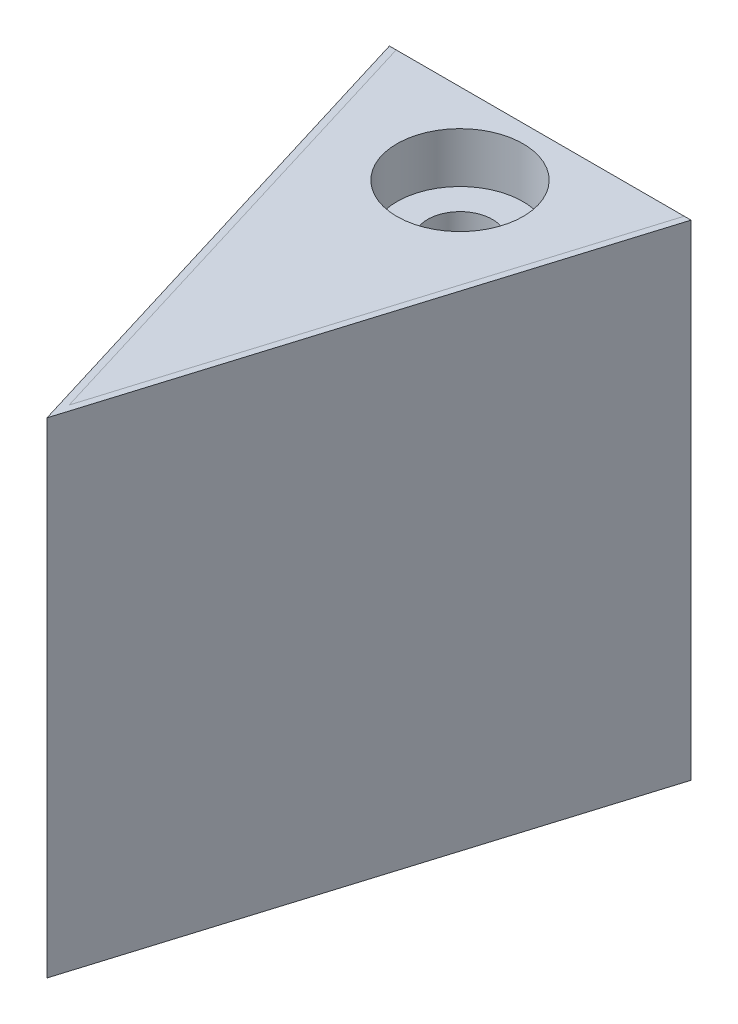
ISO-10303-21;
HEADER;
FILE_DESCRIPTION(('STEP AP214'),'2;1');
FILE_NAME('part.step','',(''),(''),'','','');
FILE_SCHEMA(('AUTOMOTIVE_DESIGN { 1 0 10303 214 1 1 1 1 }'));
ENDSEC;
DATA;
#1=APPLICATION_CONTEXT('core data for automotive mechanical design processes');
#2=APPLICATION_PROTOCOL_DEFINITION('international standard','automotive_design',2000,#1);
#3=PRODUCT_CONTEXT('',#1,'mechanical');
#4=PRODUCT('Part','Part','',(#3));
#5=PRODUCT_RELATED_PRODUCT_CATEGORY('part','',(#4));
#6=PRODUCT_DEFINITION_FORMATION('','',#4);
#7=PRODUCT_DEFINITION_CONTEXT('part definition',#1,'design');
#8=PRODUCT_DEFINITION('design','',#6,#7);
#9=PRODUCT_DEFINITION_SHAPE('','',#8);
#10=(LENGTH_UNIT() NAMED_UNIT(*) SI_UNIT(.MILLI.,.METRE.));
#11=(NAMED_UNIT(*) PLANE_ANGLE_UNIT() SI_UNIT($,.RADIAN.));
#12=(NAMED_UNIT(*) SI_UNIT($,.STERADIAN.) SOLID_ANGLE_UNIT());
#13=UNCERTAINTY_MEASURE_WITH_UNIT(LENGTH_MEASURE(1.E-05),#10,'distance_accuracy_value','');
#14=(GEOMETRIC_REPRESENTATION_CONTEXT(3) GLOBAL_UNCERTAINTY_ASSIGNED_CONTEXT((#13)) GLOBAL_UNIT_ASSIGNED_CONTEXT((#10,
#11,#12)) REPRESENTATION_CONTEXT('',''));
#15=CARTESIAN_POINT('',(0.,0.,0.));
#16=DIRECTION('',(0.,0.,1.));
#17=DIRECTION('',(1.,0.,0.));
#18=AXIS2_PLACEMENT_3D('',#15,#16,#17);
#19=CARTESIAN_POINT('',(-4.47328382881108,-2.51,4.56537000902889));
#20=DIRECTION('',(0.956304755963033,0.,-0.292371704722745));
#21=DIRECTION('',(-0.292371704722745,0.,-0.956304755963033));
#22=AXIS2_PLACEMENT_3D('',#19,#20,#21);
#23=PLANE('',#22);
#24=DIRECTION('',(0.,1.,0.));
#25=VECTOR('',#24,1.);
#26=CARTESIAN_POINT('',(-0.0200292878637927,-2.51,19.1313092850622));
#27=LINE('',#26,#25);
#28=CARTESIAN_POINT('',(-0.0200292878637948,-2.5,19.1313092850622));
#29=VERTEX_POINT('',#28);
#30=CARTESIAN_POINT('',(-0.0200292878637948,12.5,19.1313092850622));
#31=VERTEX_POINT('',#30);
#32=EDGE_CURVE('E12',#29,#31,#27,.T.);
#33=ORIENTED_EDGE('',*,*,#32,.F.);
#34=DIRECTION('',(-0.292371704722745,0.,-0.956304755963033));
#35=VECTOR('',#34,1.);
#36=CARTESIAN_POINT('',(-5.36736335318275,-2.5,1.64096765560485));
#37=LINE('',#36,#35);
#38=CARTESIAN_POINT('',(-4.47328382881108,-2.5,4.56537000902889));
#39=VERTEX_POINT('',#38);
#40=EDGE_CURVE('E119',#29,#39,#37,.T.);
#41=ORIENTED_EDGE('',*,*,#40,.T.);
#42=DIRECTION('',(0.,-1.,0.));
#43=VECTOR('',#42,1.);
#44=CARTESIAN_POINT('',(-4.47328382881108,-2.5,4.56537000902889));
#45=LINE('',#44,#43);
#46=CARTESIAN_POINT('',(-4.47328382881108,12.5,4.56537000902889));
#47=VERTEX_POINT('',#46);
#48=EDGE_CURVE('E115',#47,#39,#45,.T.);
#49=ORIENTED_EDGE('',*,*,#48,.F.);
#50=DIRECTION('',(-0.292371704722745,0.,-0.956304755963033));
#51=VECTOR('',#50,1.);
#52=CARTESIAN_POINT('',(-5.36736335318275,12.5,1.64096765560485));
#53=LINE('',#52,#51);
#54=EDGE_CURVE('E126',#31,#47,#53,.T.);
#55=ORIENTED_EDGE('',*,*,#54,.F.);
#56=EDGE_LOOP('',(#33,#41,#49,#55));
#57=FACE_BOUND('',#56,.T.);
#58=ADVANCED_FACE('F44',(#57),#23,.T.);
#59=CARTESIAN_POINT('',(-0.0200292878637927,-2.51,19.1313092850622));
#60=DIRECTION('',(-0.956304755963036,0.,-0.292371704722737));
#61=DIRECTION('',(-0.292371704722737,0.,0.956304755963036));
#62=AXIS2_PLACEMENT_3D('',#59,#60,#61);
#63=PLANE('',#62);
#64=DIRECTION('',(0.,1.,0.));
#65=VECTOR('',#64,1.);
#66=CARTESIAN_POINT('',(4.43322525308335,-2.5,4.56537000902889));
#67=LINE('',#66,#65);
#68=CARTESIAN_POINT('',(4.43322525308335,-2.5,4.56537000902889));
#69=VERTEX_POINT('',#68);
#70=CARTESIAN_POINT('',(4.43322525308335,12.5,4.56537000902889));
#71=VERTEX_POINT('',#70);
#72=EDGE_CURVE('E103',#69,#71,#67,.T.);
#73=ORIENTED_EDGE('',*,*,#72,.F.);
#74=DIRECTION('',(-0.292371704722737,0.,0.956304755963036));
#75=VECTOR('',#74,1.);
#76=CARTESIAN_POINT('',(5.33072903312821,-2.5,1.62976741996975));
#77=LINE('',#76,#75);
#78=EDGE_CURVE('E112',#69,#29,#77,.T.);
#79=ORIENTED_EDGE('',*,*,#78,.T.);
#80=ORIENTED_EDGE('',*,*,#32,.T.);
#81=DIRECTION('',(-0.292371704722737,0.,0.956304755963036));
#82=VECTOR('',#81,1.);
#83=CARTESIAN_POINT('',(5.33072903312821,12.5,1.62976741996975));
#84=LINE('',#83,#82);
#85=EDGE_CURVE('E114',#71,#31,#84,.T.);
#86=ORIENTED_EDGE('',*,*,#85,.F.);
#87=EDGE_LOOP('',(#73,#79,#80,#86));
#88=FACE_BOUND('',#87,.T.);
#89=ADVANCED_FACE('F111',(#88),#63,.T.);
#90=CARTESIAN_POINT('',(0.,12.5,0.));
#91=DIRECTION('',(0.,1.,0.));
#92=DIRECTION('',(0.,0.,1.));
#93=AXIS2_PLACEMENT_3D('',#90,#91,#92);
#94=PLANE('',#93);
#95=DIRECTION('',(-1.,0.,0.));
#96=VECTOR('',#95,1.);
#97=CARTESIAN_POINT('',(4.64236360438078,12.5,4.56537000902889));
#98=LINE('',#97,#96);
#99=CARTESIAN_POINT('',(4.64236360438078,12.5,4.56537000902889));
#100=VERTEX_POINT('',#99);
#101=EDGE_CURVE('E48',#100,#71,#98,.T.);
#102=ORIENTED_EDGE('',*,*,#101,.T.);
#103=ORIENTED_EDGE('',*,*,#85,.T.);
#104=ORIENTED_EDGE('',*,*,#54,.T.);
#105=CARTESIAN_POINT('',(-4.68242218010851,12.5,4.56537000902889));
#106=VERTEX_POINT('',#105);
#107=EDGE_CURVE('E133',#47,#106,#98,.T.);
#108=ORIENTED_EDGE('',*,*,#107,.T.);
#109=DIRECTION('',(0.292371704722747,0.,0.956304755963032));
#110=VECTOR('',#109,1.);
#111=CARTESIAN_POINT('',(-0.0200292878637907,12.5,19.8153700090289));
#112=LINE('',#111,#110);
#113=CARTESIAN_POINT('',(-0.0200292878637907,12.5,19.8153700090289));
#114=VERTEX_POINT('',#113);
#115=EDGE_CURVE('E53',#106,#114,#112,.T.);
#116=ORIENTED_EDGE('',*,*,#115,.T.);
#117=DIRECTION('',(0.292371704722737,0.,-0.956304755963035));
#118=VECTOR('',#117,1.);
#119=CARTESIAN_POINT('',(0.973595426876858,12.5,16.5653700090289));
#120=LINE('',#119,#118);
#121=EDGE_CURVE('E131',#114,#100,#120,.T.);
#122=ORIENTED_EDGE('',*,*,#121,.T.);
#123=EDGE_LOOP('',(#102,#103,#104,#108,#116,#122));
#124=FACE_BOUND('',#123,.T.);
#125=ADVANCED_FACE('F148',(#124),#94,.T.);
#126=CARTESIAN_POINT('',(4.64236360438078,-2.5,4.56537000902889));
#127=DIRECTION('',(0.,0.,-1.));
#128=DIRECTION('',(-1.,0.,0.));
#129=AXIS2_PLACEMENT_3D('',#126,#127,#128);
#130=PLANE('',#129);
#131=DIRECTION('',(-1.,0.,0.));
#132=VECTOR('',#131,1.);
#133=CARTESIAN_POINT('',(4.64236360438078,-2.5,4.56537000902889));
#134=LINE('',#133,#132);
#135=CARTESIAN_POINT('',(4.64236360438078,-2.5,4.56537000902889));
#136=VERTEX_POINT('',#135);
#137=EDGE_CURVE('E99',#136,#69,#134,.T.);
#138=ORIENTED_EDGE('',*,*,#137,.T.);
#139=ORIENTED_EDGE('',*,*,#72,.T.);
#140=ORIENTED_EDGE('',*,*,#101,.F.);
#141=DIRECTION('',(0.,1.,0.));
#142=VECTOR('',#141,1.);
#143=CARTESIAN_POINT('',(4.64236360438078,-2.5,4.56537000902889));
#144=LINE('',#143,#142);
#145=EDGE_CURVE('E68',#136,#100,#144,.T.);
#146=ORIENTED_EDGE('',*,*,#145,.F.);
#147=EDGE_LOOP('',(#138,#139,#140,#146));
#148=FACE_BOUND('',#147,.T.);
#149=ADVANCED_FACE('F101',(#148),#130,.T.);
#150=CARTESIAN_POINT('',(0.973595426876858,-2.5,16.5653700090289));
#151=DIRECTION('',(0.956304755963036,0.,0.292371704722736));
#152=DIRECTION('',(0.292371704722736,0.,-0.956304755963036));
#153=AXIS2_PLACEMENT_3D('',#150,#151,#152);
#154=PLANE('',#153);
#155=ORIENTED_EDGE('',*,*,#145,.T.);
#156=ORIENTED_EDGE('',*,*,#121,.F.);
#157=DIRECTION('',(0.,1.,0.));
#158=VECTOR('',#157,1.);
#159=CARTESIAN_POINT('',(-0.0200292878637907,-2.5,19.8153700090289));
#160=LINE('',#159,#158);
#161=CARTESIAN_POINT('',(-0.0200292878637907,-2.5,19.8153700090289));
#162=VERTEX_POINT('',#161);
#163=EDGE_CURVE('E61',#162,#114,#160,.T.);
#164=ORIENTED_EDGE('',*,*,#163,.F.);
#165=DIRECTION('',(0.292371704722737,0.,-0.956304755963035));
#166=VECTOR('',#165,1.);
#167=CARTESIAN_POINT('',(0.973595426876858,-2.5,16.5653700090289));
#168=LINE('',#167,#166);
#169=EDGE_CURVE('E136',#162,#136,#168,.T.);
#170=ORIENTED_EDGE('',*,*,#169,.T.);
#171=EDGE_LOOP('',(#155,#156,#164,#170));
#172=FACE_BOUND('',#171,.T.);
#173=ADVANCED_FACE('F163',(#172),#154,.T.);
#174=CARTESIAN_POINT('',(-1.01365400260447,-2.5,16.5653700090289));
#175=DIRECTION('',(-0.956304755963033,0.,0.292371704722745));
#176=DIRECTION('',(0.292371704722745,0.,0.956304755963033));
#177=AXIS2_PLACEMENT_3D('',#174,#175,#176);
#178=PLANE('',#177);
#179=ORIENTED_EDGE('',*,*,#163,.T.);
#180=ORIENTED_EDGE('',*,*,#115,.F.);
#181=DIRECTION('',(0.,1.,0.));
#182=VECTOR('',#181,1.);
#183=CARTESIAN_POINT('',(-4.68242218010851,-2.5,4.56537000902889));
#184=LINE('',#183,#182);
#185=CARTESIAN_POINT('',(-4.68242218010851,-2.5,4.56537000902889));
#186=VERTEX_POINT('',#185);
#187=EDGE_CURVE('E127',#186,#106,#184,.T.);
#188=ORIENTED_EDGE('',*,*,#187,.F.);
#189=DIRECTION('',(0.292371704722747,0.,0.956304755963032));
#190=VECTOR('',#189,1.);
#191=CARTESIAN_POINT('',(-0.0200292878637907,-2.5,19.8153700090289));
#192=LINE('',#191,#190);
#193=EDGE_CURVE('E134',#186,#162,#192,.T.);
#194=ORIENTED_EDGE('',*,*,#193,.T.);
#195=EDGE_LOOP('',(#179,#180,#188,#194));
#196=FACE_BOUND('',#195,.T.);
#197=ADVANCED_FACE('F146',(#196),#178,.T.);
#198=ORIENTED_EDGE('',*,*,#107,.F.);
#199=ORIENTED_EDGE('',*,*,#48,.T.);
#200=EDGE_CURVE('E108',#39,#186,#134,.T.);
#201=ORIENTED_EDGE('',*,*,#200,.T.);
#202=ORIENTED_EDGE('',*,*,#187,.T.);
#203=EDGE_LOOP('',(#198,#199,#201,#202));
#204=FACE_BOUND('',#203,.T.);
#205=ADVANCED_FACE('F144',(#204),#130,.T.);
#206=CARTESIAN_POINT('',(0.,-2.5,0.));
#207=DIRECTION('',(0.,1.,0.));
#208=DIRECTION('',(0.,0.,1.));
#209=AXIS2_PLACEMENT_3D('',#206,#207,#208);
#210=PLANE('',#209);
#211=ORIENTED_EDGE('',*,*,#78,.F.);
#212=ORIENTED_EDGE('',*,*,#137,.F.);
#213=ORIENTED_EDGE('',*,*,#169,.F.);
#214=ORIENTED_EDGE('',*,*,#193,.F.);
#215=ORIENTED_EDGE('',*,*,#200,.F.);
#216=ORIENTED_EDGE('',*,*,#40,.F.);
#217=EDGE_LOOP('',(#211,#212,#213,#214,#215,#216));
#218=FACE_BOUND('',#217,.T.);
#219=ADVANCED_FACE('F46',(#218),#210,.F.);
#220=CLOSED_SHELL('',(#58,#89,#125,#149,#173,#197,#205,#219));
#221=MANIFOLD_SOLID_BREP('B2',#220);
#222=CARTESIAN_POINT('',(-4.47328382881108,-2.51,4.56537000902889));
#223=DIRECTION('',(0.956304755963033,0.,-0.292371704722745));
#224=DIRECTION('',(-0.292371704722745,0.,-0.956304755963033));
#225=AXIS2_PLACEMENT_3D('',#222,#223,#224);
#226=PLANE('',#225);
#227=DIRECTION('',(0.,1.,0.));
#228=VECTOR('',#227,1.);
#229=CARTESIAN_POINT('',(-0.0200292878637927,-2.51,19.1313092850622));
#230=LINE('',#229,#228);
#231=CARTESIAN_POINT('',(-0.0200292878637948,-2.5,19.1313092850622));
#232=VERTEX_POINT('',#231);
#233=CARTESIAN_POINT('',(-0.0200292878637948,12.5,19.1313092850622));
#234=VERTEX_POINT('',#233);
#235=EDGE_CURVE('E42',#232,#234,#230,.T.);
#236=ORIENTED_EDGE('',*,*,#235,.T.);
#237=DIRECTION('',(-0.292371704722745,0.,-0.956304755963033));
#238=VECTOR('',#237,1.);
#239=CARTESIAN_POINT('',(-5.36736335318275,12.5,1.64096765560485));
#240=LINE('',#239,#238);
#241=CARTESIAN_POINT('',(-4.47328382881108,12.5,4.56537000902889));
#242=VERTEX_POINT('',#241);
#243=EDGE_CURVE('E231',#234,#242,#240,.T.);
#244=ORIENTED_EDGE('',*,*,#243,.T.);
#245=DIRECTION('',(0.,-1.,0.));
#246=VECTOR('',#245,1.);
#247=CARTESIAN_POINT('',(-4.47328382881108,-2.5,4.56537000902889));
#248=LINE('',#247,#246);
#249=CARTESIAN_POINT('',(-4.47328382881108,-2.5,4.56537000902889));
#250=VERTEX_POINT('',#249);
#251=EDGE_CURVE('E247',#242,#250,#248,.T.);
#252=ORIENTED_EDGE('',*,*,#251,.T.);
#253=DIRECTION('',(-0.292371704722745,0.,-0.956304755963033));
#254=VECTOR('',#253,1.);
#255=CARTESIAN_POINT('',(-5.36736335318275,-2.5,1.64096765560485));
#256=LINE('',#255,#254);
#257=EDGE_CURVE('E332',#232,#250,#256,.T.);
#258=ORIENTED_EDGE('',*,*,#257,.F.);
#259=EDGE_LOOP('',(#236,#244,#252,#258));
#260=FACE_BOUND('',#259,.T.);
#261=ADVANCED_FACE('F222',(#260),#226,.F.);
#262=CARTESIAN_POINT('',(-0.0200292878637927,-2.51,19.1313092850622));
#263=DIRECTION('',(-0.956304755963036,0.,-0.292371704722737));
#264=DIRECTION('',(-0.292371704722737,0.,0.956304755963036));
#265=AXIS2_PLACEMENT_3D('',#262,#263,#264);
#266=PLANE('',#265);
#267=DIRECTION('',(0.,1.,0.));
#268=VECTOR('',#267,1.);
#269=CARTESIAN_POINT('',(4.43322525308335,-2.5,4.56537000902889));
#270=LINE('',#269,#268);
#271=CARTESIAN_POINT('',(4.43322525308335,-2.5,4.56537000902889));
#272=VERTEX_POINT('',#271);
#273=CARTESIAN_POINT('',(4.43322525308335,12.5,4.56537000902889));
#274=VERTEX_POINT('',#273);
#275=EDGE_CURVE('E345',#272,#274,#270,.T.);
#276=ORIENTED_EDGE('',*,*,#275,.T.);
#277=DIRECTION('',(-0.292371704722737,0.,0.956304755963036));
#278=VECTOR('',#277,1.);
#279=CARTESIAN_POINT('',(5.33072903312821,12.5,1.62976741996975));
#280=LINE('',#279,#278);
#281=EDGE_CURVE('E239',#274,#234,#280,.T.);
#282=ORIENTED_EDGE('',*,*,#281,.T.);
#283=ORIENTED_EDGE('',*,*,#235,.F.);
#284=DIRECTION('',(-0.292371704722737,0.,0.956304755963036));
#285=VECTOR('',#284,1.);
#286=CARTESIAN_POINT('',(5.33072903312821,-2.5,1.62976741996975));
#287=LINE('',#286,#285);
#288=EDGE_CURVE('E226',#272,#232,#287,.T.);
#289=ORIENTED_EDGE('',*,*,#288,.F.);
#290=EDGE_LOOP('',(#276,#282,#283,#289));
#291=FACE_BOUND('',#290,.T.);
#292=ADVANCED_FACE('F224',(#291),#266,.F.);
#293=CARTESIAN_POINT('',(-0.0200292878638651,5.,9.56537000902889));
#294=DIRECTION('',(0.,0.,-1.));
#295=DIRECTION('',(-1.,0.,0.));
#296=AXIS2_PLACEMENT_3D('',#293,#294,#295);
#297=PLANE('',#296);
#298=CARTESIAN_POINT('',(-0.0200292878638651,5.,9.56537000902889));
#299=DIRECTION('',(0.,0.,-1.));
#300=DIRECTION('',(-1.,0.,0.));
#301=AXIS2_PLACEMENT_3D('',#298,#299,#300);
#302=CIRCLE('',#301,3.05);
#303=CARTESIAN_POINT('',(2.87824606137402,4.05,9.56537000902889));
#304=VERTEX_POINT('',#303);
#305=CARTESIAN_POINT('',(-2.91830463710175,4.05,9.56537000902889));
#306=VERTEX_POINT('',#305);
#307=EDGE_CURVE('E313',#304,#306,#302,.T.);
#308=ORIENTED_EDGE('',*,*,#307,.T.);
#309=DIRECTION('',(1.,0.,0.));
#310=VECTOR('',#309,1.);
#311=CARTESIAN_POINT('',(2.87824606137402,4.05,9.56537000902889));
#312=LINE('',#311,#310);
#313=EDGE_CURVE('E316',#306,#304,#312,.T.);
#314=ORIENTED_EDGE('',*,*,#313,.T.);
#315=EDGE_LOOP('',(#308,#314));
#316=FACE_BOUND('',#315,.T.);
#317=ADVANCED_FACE('F412',(#316),#297,.T.);
#318=CARTESIAN_POINT('',(0.,-2.5,7.06537000902889));
#319=DIRECTION('',(0.,1.,0.));
#320=DIRECTION('',(0.,0.,1.));
#321=AXIS2_PLACEMENT_3D('',#318,#319,#320);
#322=CYLINDRICAL_SURFACE('',#321,0.999999999999795);
#323=CARTESIAN_POINT('',(0.,5.95,7.06537000902889));
#324=DIRECTION('',(0.,-1.,0.));
#325=DIRECTION('',(0.,0.,-1.));
#326=AXIS2_PLACEMENT_3D('',#323,#324,#325);
#327=CIRCLE('',#326,0.999999999999795);
#328=CARTESIAN_POINT('',(0.,5.95,6.06537000902909));
#329=VERTEX_POINT('',#328);
#330=EDGE_CURVE('E333',#329,#329,#327,.T.);
#331=ORIENTED_EDGE('',*,*,#330,.F.);
#332=EDGE_LOOP('',(#331));
#333=FACE_BOUND('',#332,.T.);
#334=CARTESIAN_POINT('',(0.,4.05,7.06537000902889));
#335=DIRECTION('',(0.,1.,0.));
#336=DIRECTION('',(0.,0.,1.));
#337=AXIS2_PLACEMENT_3D('',#334,#335,#336);
#338=CIRCLE('',#337,0.999999999999795);
#339=CARTESIAN_POINT('',(0.,4.05,8.06537000902868));
#340=VERTEX_POINT('',#339);
#341=EDGE_CURVE('E378',#340,#340,#338,.T.);
#342=ORIENTED_EDGE('',*,*,#341,.F.);
#343=EDGE_LOOP('',(#342));
#344=FACE_BOUND('',#343,.T.);
#345=ADVANCED_FACE('F388',(#333,#344),#322,.F.);
#346=CARTESIAN_POINT('',(-0.0200292878638651,5.,9.56537000902889));
#347=DIRECTION('',(0.,0.,-1.));
#348=DIRECTION('',(-1.,0.,0.));
#349=AXIS2_PLACEMENT_3D('',#346,#347,#348);
#350=PLANE('',#349);
#351=CARTESIAN_POINT('',(-0.0200292878638651,5.,9.56537000902889));
#352=DIRECTION('',(0.,0.,-1.));
#353=DIRECTION('',(-1.,0.,0.));
#354=AXIS2_PLACEMENT_3D('',#351,#352,#353);
#355=CIRCLE('',#354,3.05);
#356=CARTESIAN_POINT('',(-2.91830463710175,5.95,9.56537000902889));
#357=VERTEX_POINT('',#356);
#358=CARTESIAN_POINT('',(2.87824606137402,5.95,9.56537000902889));
#359=VERTEX_POINT('',#358);
#360=EDGE_CURVE('E289',#357,#359,#355,.T.);
#361=ORIENTED_EDGE('',*,*,#360,.T.);
#362=DIRECTION('',(-1.,0.,0.));
#363=VECTOR('',#362,1.);
#364=CARTESIAN_POINT('',(2.87824606137402,5.95,9.56537000902889));
#365=LINE('',#364,#363);
#366=EDGE_CURVE('E298',#359,#357,#365,.T.);
#367=ORIENTED_EDGE('',*,*,#366,.T.);
#368=EDGE_LOOP('',(#361,#367));
#369=FACE_BOUND('',#368,.T.);
#370=ADVANCED_FACE('F301',(#369),#350,.T.);
#371=CARTESIAN_POINT('',(0.,8.04993423332826,8.06537000902868));
#372=CARTESIAN_POINT('',(0.0546821791008591,8.04957510796066,8.06537003134291));
#373=CARTESIAN_POINT('',(0.109354914126314,8.04773172784493,8.0608700796451));
#374=CARTESIAN_POINT('',(0.217072928600975,8.04124911512673,8.0430513451388));
#375=CARTESIAN_POINT('',(0.270117951898954,8.03660944482241,8.02973118167488));
#376=CARTESIAN_POINT('',(0.373013096085542,8.02501178523379,7.9947834956713));
#377=CARTESIAN_POINT('',(0.422868473539478,8.01805773388006,7.97317007466059));
#378=CARTESIAN_POINT('',(0.518239677542278,8.00251631313627,7.92231226129294));
#379=CARTESIAN_POINT('',(0.563754694999946,7.99392864011109,7.89306644995588));
#380=CARTESIAN_POINT('',(0.650728756928365,7.97567153728033,7.82670873711478));
#381=CARTESIAN_POINT('',(0.692016888170353,7.96597671144104,7.789379829442));
#382=CARTESIAN_POINT('',(0.767869116779319,7.94673554743408,7.7083762283634));
#383=CARTESIAN_POINT('',(0.802431776578928,7.93718924141278,7.66470018173609));
#384=CARTESIAN_POINT('',(0.864765151781457,7.91902793004534,7.5707826132558));
#385=CARTESIAN_POINT('',(0.892326299349008,7.91044519441132,7.52039518357941));
#386=CARTESIAN_POINT('',(0.938505856826815,7.89556616206647,7.41536260915563));
#387=CARTESIAN_POINT('',(0.957127077871142,7.88926914676962,7.36071880910146));
#388=CARTESIAN_POINT('',(0.984242433141647,7.87995461814357,7.25073786122397));
#389=CARTESIAN_POINT('',(0.993067689027361,7.87683020189835,7.19549165552765));
#390=CARTESIAN_POINT('',(1.00137637507627,7.87389140563375,7.0842210997125));
#391=CARTESIAN_POINT('',(1.00086267310011,7.87407600946129,7.02819699375629));
#392=CARTESIAN_POINT('',(0.99076096088365,7.87764266918273,6.91967266210838));
#393=CARTESIAN_POINT('',(0.981587657973599,7.88087859001705,6.86712821582431));
#394=CARTESIAN_POINT('',(0.955100149434765,7.8899509641507,6.76437204334019));
#395=CARTESIAN_POINT('',(0.937784973426303,7.89578772742408,6.71416059597993));
#396=CARTESIAN_POINT('',(0.895224866547381,7.90952145894585,6.61653210436769));
#397=CARTESIAN_POINT('',(0.869854126003332,7.91745075100137,6.56917464604347));
#398=CARTESIAN_POINT('',(0.811993742784764,7.93447527343163,6.47925869308694));
#399=CARTESIAN_POINT('',(0.779502046774439,7.94357083978839,6.43670158801433));
#400=CARTESIAN_POINT('',(0.706310455681535,7.96250407370069,6.35524458013623));
#401=CARTESIAN_POINT('',(0.665269123333407,7.97235562915799,6.31665408360598));
#402=CARTESIAN_POINT('',(0.57718349640282,7.99129803558887,6.24682351617368));
#403=CARTESIAN_POINT('',(0.530138584475256,8.00038880817212,6.21558420213093));
#404=CARTESIAN_POINT('',(0.430676287465459,8.01694054662288,6.16106484602444));
#405=CARTESIAN_POINT('',(0.378205748438876,8.0243825903494,6.13787563631923));
#406=CARTESIAN_POINT('',(0.269803272333861,8.03668686866806,6.10075330920549));
#407=CARTESIAN_POINT('',(0.213872509814023,8.04154997336318,6.08681706955583));
#408=CARTESIAN_POINT('',(0.102675980012124,8.04801791966975,6.06913107849329));
#409=CARTESIAN_POINT('',(0.0474822649655247,8.04975195790472,6.06497514173016));
#410=CARTESIAN_POINT('',(-0.0628415625782379,8.05019803748363,6.0658238541015));
#411=CARTESIAN_POINT('',(-0.11797168444029,8.04891060250071,6.07082691579136));
#412=CARTESIAN_POINT('',(-0.224905098860222,8.04356865345438,6.0895227717292));
#413=CARTESIAN_POINT('',(-0.27675855569376,8.03959688095123,6.10295488916953));
#414=CARTESIAN_POINT('',(-0.377465816854332,8.02940636298488,6.13781410513821));
#415=CARTESIAN_POINT('',(-0.426319262034692,8.02318734910412,6.15924215873627));
#416=CARTESIAN_POINT('',(-0.520961047176242,8.00897230857037,6.2100604659352));
#417=CARTESIAN_POINT('',(-0.566646489467878,8.0009368899842,6.2396309979426));
#418=CARTESIAN_POINT('',(-0.65254261544519,7.98401517307969,6.30568228657445));
#419=CARTESIAN_POINT('',(-0.692751707956591,7.97512862873551,6.34216504424128));
#420=CARTESIAN_POINT('',(-0.768368832186386,7.9570367257478,6.42287653863802));
#421=CARTESIAN_POINT('',(-0.803492685593696,7.94783427305369,6.46737277538544));
#422=CARTESIAN_POINT('',(-0.865812896971176,7.93056297373217,6.561814306128));
#423=CARTESIAN_POINT('',(-0.893009191170616,7.92249413622404,6.61175964395225));
#424=CARTESIAN_POINT('',(-0.938600028099442,7.908487452095,6.71573217026841));
#425=CARTESIAN_POINT('',(-0.957006080265417,7.90254682148472,6.76975391336835));
#426=CARTESIAN_POINT('',(-0.984385447206509,7.89356679235751,6.88036261430816));
#427=CARTESIAN_POINT('',(-0.993362642639482,7.89052620031194,6.93694850680402));
#428=CARTESIAN_POINT('',(-1.00133163032267,7.88782991758724,7.04818230585044));
#429=CARTESIAN_POINT('',(-1.00077845522218,7.8880199719282,7.10279422493158));
#430=CARTESIAN_POINT('',(-0.990816979227545,7.89138344959095,7.21110590212351));
#431=CARTESIAN_POINT('',(-0.981409159874996,7.89455671067717,7.26480570967594));
#432=CARTESIAN_POINT('',(-0.954326006544325,7.90340934975765,7.36885594585062));
#433=CARTESIAN_POINT('',(-0.936795159679116,7.9090448351629,7.41924801009586));
#434=CARTESIAN_POINT('',(-0.894078597598813,7.92216267155434,7.51641516301269));
#435=CARTESIAN_POINT('',(-0.868891247980455,7.92964541680364,7.56318947674054));
#436=CARTESIAN_POINT('',(-0.810369867509382,7.94598359665686,7.6538685388687));
#437=CARTESIAN_POINT('',(-0.776744477808668,7.95488269367938,7.69757735474066));
#438=CARTESIAN_POINT('',(-0.702796321419838,7.97283954400193,7.77888143930107));
#439=CARTESIAN_POINT('',(-0.662471761379352,7.98189733920272,7.81647506561977));
#440=CARTESIAN_POINT('',(-0.574566833244119,7.99951060425292,7.88580532807814));
#441=CARTESIAN_POINT('',(-0.526781666832324,8.00803733466461,7.91729045245042));
#442=CARTESIAN_POINT('',(-0.42631739774142,8.02324420992155,7.97174481231142));
#443=CARTESIAN_POINT('',(-0.373639825535698,8.02992492966523,7.99471669981805));
#444=CARTESIAN_POINT('',(-0.268082191246842,8.04033135878708,8.03027889077588));
#445=CARTESIAN_POINT('',(-0.215395649662781,8.0442075496374,8.0433995880839));
#446=CARTESIAN_POINT('',(-0.108469393021745,8.04918673358594,8.06094409709436));
#447=CARTESIAN_POINT('',(-0.0542300522364904,8.05029038935139,8.06536998689896));
#448=CARTESIAN_POINT('',(0.,8.04993423332826,8.06537000902868));
#449=B_SPLINE_CURVE_WITH_KNOTS('',3,(#371,#372,#373,#374,#375,#376,#377,#378,#379,#380,#381,
#382,#383,#384,#385,#386,#387,#388,#389,#390,#391,#392,#393,#394,#395,#396,#397,#398,#399,#400,
#401,#402,#403,#404,#405,#406,#407,#408,#409,#410,#411,#412,#413,#414,#415,#416,#417,#418,#419,
#420,#421,#422,#423,#424,#425,#426,#427,#428,#429,#430,#431,#432,#433,#434,#435,#436,#437,#438,
#439,#440,#441,#442,#443,#444,#445,#446,#447,#448),.UNSPECIFIED.,.T.,.F.,(4,2,2,2,2,2,2,2,2,2,2,
2,2,2,2,2,2,2,2,2,2,2,2,2,2,2,2,2,2,2,2,2,2,2,2,2,2,2,4),(0.,0.163850025249576,
0.327725704522648,0.491323962064708,0.654952656763252,0.823688007705309,0.992459386251062,
1.16580686426493,1.33909979790541,1.50633759959778,1.67352404581624,1.83308952664912,
1.99267402993055,2.15488479838887,2.31714240219587,2.48792062945066,2.65871643191758,
2.83138111770078,3.00398751137513,3.16928819199399,3.33456022528501,3.49495717905625,
3.65537329747941,3.81967478229688,3.98402390415546,4.15550728499603,4.32699204524211,
4.49825165341348,4.66944074819149,4.83247997411711,4.99551033400225,5.15574601024891,
5.31601591541804,5.48284858292629,5.64972598333098,5.8224532304353,5.99512662474744,
6.15766074540814,6.32015601487876),.UNSPECIFIED.);
#450=CARTESIAN_POINT('',(0.,8.04993423332826,8.06537000902868));
#451=VERTEX_POINT('',#450);
#452=EDGE_CURVE('E336',#451,#451,#449,.T.);
#453=ORIENTED_EDGE('',*,*,#452,.F.);
#454=EDGE_LOOP('',(#453));
#455=FACE_BOUND('',#454,.T.);
#456=CARTESIAN_POINT('',(0.,10.95,7.06537000902889));
#457=DIRECTION('',(0.,1.,0.));
#458=DIRECTION('',(0.,0.,1.));
#459=AXIS2_PLACEMENT_3D('',#456,#457,#458);
#460=CIRCLE('',#459,0.999999999999795);
#461=CARTESIAN_POINT('',(0.,10.95,8.06537000902868));
#462=VERTEX_POINT('',#461);
#463=EDGE_CURVE('E338',#462,#462,#460,.F.);
#464=ORIENTED_EDGE('',*,*,#463,.F.);
#465=EDGE_LOOP('',(#464));
#466=FACE_BOUND('',#465,.T.);
#467=ADVANCED_FACE('F387',(#455,#466),#322,.F.);
#468=CARTESIAN_POINT('',(0.,10.95,7.06537000902889));
#469=DIRECTION('',(0.,1.,0.));
#470=DIRECTION('',(0.,0.,1.));
#471=AXIS2_PLACEMENT_3D('',#468,#469,#470);
#472=PLANE('',#471);
#473=CARTESIAN_POINT('',(0.,10.95,7.06537000902889));
#474=DIRECTION('',(0.,1.,0.));
#475=DIRECTION('',(0.,0.,1.));
#476=AXIS2_PLACEMENT_3D('',#473,#474,#475);
#477=CIRCLE('',#476,1.95);
#478=CARTESIAN_POINT('',(0.,10.95,9.01537000902889));
#479=VERTEX_POINT('',#478);
#480=EDGE_CURVE('E341',#479,#479,#477,.T.);
#481=ORIENTED_EDGE('',*,*,#480,.T.);
#482=EDGE_LOOP('',(#481));
#483=FACE_BOUND('',#482,.T.);
#484=ORIENTED_EDGE('',*,*,#463,.T.);
#485=EDGE_LOOP('',(#484));
#486=FACE_BOUND('',#485,.T.);
#487=ADVANCED_FACE('F429',(#483,#486),#472,.T.);
#488=CARTESIAN_POINT('',(2.87824606137402,4.05,9.56537000902889));
#489=DIRECTION('',(0.,1.,0.));
#490=DIRECTION('',(0.,0.,1.));
#491=AXIS2_PLACEMENT_3D('',#488,#489,#490);
#492=PLANE('',#491);
#493=ORIENTED_EDGE('',*,*,#341,.T.);
#494=EDGE_LOOP('',(#493));
#495=FACE_BOUND('',#494,.T.);
#496=DIRECTION('',(1.,0.,0.));
#497=VECTOR('',#496,1.);
#498=CARTESIAN_POINT('',(2.87824606137402,4.05,4.56537000902889));
#499=LINE('',#498,#497);
#500=CARTESIAN_POINT('',(-2.91830463710175,4.05,4.56537000902889));
#501=VERTEX_POINT('',#500);
#502=CARTESIAN_POINT('',(2.87824606137402,4.05,4.56537000902889));
#503=VERTEX_POINT('',#502);
#504=EDGE_CURVE('E317',#501,#503,#499,.T.);
#505=ORIENTED_EDGE('',*,*,#504,.T.);
#506=DIRECTION('',(0.,0.,-1.));
#507=VECTOR('',#506,1.);
#508=CARTESIAN_POINT('',(2.87824606137402,4.05,9.56537000902889));
#509=LINE('',#508,#507);
#510=EDGE_CURVE('E324',#304,#503,#509,.T.);
#511=ORIENTED_EDGE('',*,*,#510,.F.);
#512=ORIENTED_EDGE('',*,*,#313,.F.);
#513=DIRECTION('',(0.,0.,-1.));
#514=VECTOR('',#513,1.);
#515=CARTESIAN_POINT('',(-2.91830463710175,4.05,9.56537000902889));
#516=LINE('',#515,#514);
#517=EDGE_CURVE('E320',#306,#501,#516,.T.);
#518=ORIENTED_EDGE('',*,*,#517,.T.);
#519=EDGE_LOOP('',(#505,#511,#512,#518));
#520=FACE_BOUND('',#519,.T.);
#521=ADVANCED_FACE('F401',(#495,#520),#492,.F.);
#522=CARTESIAN_POINT('',(-0.0200292878638651,5.,9.56537000902889));
#523=DIRECTION('',(0.,0.,-1.));
#524=DIRECTION('',(-1.,0.,0.));
#525=AXIS2_PLACEMENT_3D('',#522,#523,#524);
#526=CYLINDRICAL_SURFACE('',#525,3.05);
#527=CARTESIAN_POINT('',(0.,1.95006576667174,8.06537000902868));
#528=CARTESIAN_POINT('',(-0.0545467083170213,1.94970747285087,8.06537014842768));
#529=CARTESIAN_POINT('',(-0.109102594425875,1.95082617973328,8.0608924995377));
#530=CARTESIAN_POINT('',(-0.216630559947825,1.95586683343102,8.04314372343465));
#531=CARTESIAN_POINT('',(-0.269602455019722,1.95978910520613,8.02987157686885));
#532=CARTESIAN_POINT('',(-0.372395540865111,1.96998281568037,7.9950275098491));
#533=CARTESIAN_POINT('',(-0.422221565195225,1.97625054265354,7.973468701733));
#534=CARTESIAN_POINT('',(-0.517558158763021,1.99046661490332,7.92272142069787));
#535=CARTESIAN_POINT('',(-0.563067913976883,1.9984152762853,7.89353151248061));
#536=CARTESIAN_POINT('',(-0.649966255197754,2.0154231807719,7.82735020137387));
#537=CARTESIAN_POINT('',(-0.691194169171496,2.02450822082243,7.79015451043477));
#538=CARTESIAN_POINT('',(-0.766956256715783,2.04261595831002,7.7094526800914));
#539=CARTESIAN_POINT('',(-0.801489039696813,2.05163864242117,7.66594523299885));
#540=CARTESIAN_POINT('',(-0.863833114798163,2.06886144062743,7.57236170710818));
#541=CARTESIAN_POINT('',(-0.891427757355958,2.07703123807653,7.5221351619421));
#542=CARTESIAN_POINT('',(-0.937715224095409,2.09122999962885,7.41745339240553));
#543=CARTESIAN_POINT('',(-0.956410489644233,2.09725955075052,7.36299933254285));
#544=CARTESIAN_POINT('',(-0.98378774157987,2.10623552314352,7.25316209699885));
#545=CARTESIAN_POINT('',(-0.992758921547917,2.10927073194073,7.19785848159756));
#546=CARTESIAN_POINT('',(-1.00133622536939,2.1121705310223,7.08645414512163));
#547=CARTESIAN_POINT('',(-1.00094504098822,2.11203603262665,7.03035365779079));
#548=CARTESIAN_POINT('',(-0.991038308718468,2.10869152283109,6.92147912268892));
#549=CARTESIAN_POINT('',(-0.981911130689609,2.10561242249054,6.86866501351363));
#550=CARTESIAN_POINT('',(-0.955426185023448,2.09694560803578,6.76536168143749));
#551=CARTESIAN_POINT('',(-0.938067486579282,2.09135761022334,6.71487272216934));
#552=CARTESIAN_POINT('',(-0.895355477528405,2.07821837470153,6.6167672431692));
#553=CARTESIAN_POINT('',(-0.869886126954097,2.07063893932841,6.5692051855977));
#554=CARTESIAN_POINT('',(-0.811753224255465,2.05439616233121,6.47890419675966));
#555=CARTESIAN_POINT('',(-0.779087700884409,2.04573252399295,6.43616659191586));
#556=CARTESIAN_POINT('',(-0.705621370189618,2.02780243830253,6.35455640683283));
#557=CARTESIAN_POINT('',(-0.664503649472307,2.01852709526581,6.31597050530051));
#558=CARTESIAN_POINT('',(-0.57625917050636,2.00081162712214,6.24616898216816));
#559=CARTESIAN_POINT('',(-0.529131951252226,1.99237156618035,6.21495392653086));
#560=CARTESIAN_POINT('',(-0.42967631027486,1.97721392807559,6.16059752963539));
#561=CARTESIAN_POINT('',(-0.377310405391615,1.97051020892516,6.13752064297751));
#562=CARTESIAN_POINT('',(-0.269171299120882,1.9597079998363,6.10058591678685));
#563=CARTESIAN_POINT('',(-0.213399241292621,1.95560864074058,6.08672500152104));
#564=CARTESIAN_POINT('',(-0.10253908456766,1.95063259271298,6.06912548318687));
#565=CARTESIAN_POINT('',(-0.0475199824239522,1.94962825812152,6.06498767267624));
#566=CARTESIAN_POINT('',(0.0624178408306011,1.95061930503421,6.06580783262257));
#567=CARTESIAN_POINT('',(0.117336575934049,1.95261423039507,6.07076441998072));
#568=CARTESIAN_POINT('',(0.224019697915292,1.95932166494474,6.08932142334608));
#569=CARTESIAN_POINT('',(0.275829029613629,1.96396161104079,6.10269199072763));
#570=CARTESIAN_POINT('',(0.376441018754687,1.97545416982598,6.1374016340776));
#571=CARTESIAN_POINT('',(0.425243272951458,1.98230707850544,6.15874177606015));
#572=CARTESIAN_POINT('',(0.519942958677845,1.99778474493448,6.20943615236094));
#573=CARTESIAN_POINT('',(0.565724086676077,2.00645292462781,6.23899404054972));
#574=CARTESIAN_POINT('',(0.65180500165392,2.02458793082162,6.30504407730197));
#575=CARTESIAN_POINT('',(0.692103118494657,2.03405499924922,6.34153833062207));
#576=CARTESIAN_POINT('',(0.767932225486806,2.05327037108428,6.42234306540777));
#577=CARTESIAN_POINT('',(0.803172677487142,2.06301253612594,6.46692833440378));
#578=CARTESIAN_POINT('',(0.865699423276716,2.08125899142385,6.5616021249502));
#579=CARTESIAN_POINT('',(0.892985766856479,2.08976328942864,6.61169061204926));
#580=CARTESIAN_POINT('',(0.938651779165637,2.10448494111707,6.71586576519746));
#581=CARTESIAN_POINT('',(0.957065998669795,2.11071114322027,6.76993596046547));
#582=CARTESIAN_POINT('',(0.984445615434366,2.12011390689645,6.88066589489971));
#583=CARTESIAN_POINT('',(0.993415282022461,2.12329184635206,6.93732445192374));
#584=CARTESIAN_POINT('',(1.00132679388868,2.12609197133263,7.04845788777591));
#585=CARTESIAN_POINT('',(1.00076507768828,2.12589019545742,7.10289342027352));
#586=CARTESIAN_POINT('',(0.990844746741187,2.12238627741313,7.21085016959212));
#587=CARTESIAN_POINT('',(0.981486635847406,2.11908431282127,7.26437143860285));
#588=CARTESIAN_POINT('',(0.954582416471499,2.1098742046831,7.36800345557402));
#589=CARTESIAN_POINT('',(0.937190144831295,2.10401513574912,7.41815883854906));
#590=CARTESIAN_POINT('',(0.894835988822796,2.090358382842,7.51487803621554));
#591=CARTESIAN_POINT('',(0.869872431323104,2.08256027044038,7.56144105419678));
#592=CARTESIAN_POINT('',(0.811804845722808,2.06546338643234,7.65187315687851));
#593=CARTESIAN_POINT('',(0.778391036585527,2.05611369258926,7.69553364274029));
#594=CARTESIAN_POINT('',(0.704904242322278,2.03716191630836,7.77678571189248));
#595=CARTESIAN_POINT('',(0.664829330890099,2.02755976154021,7.81437553340602));
#596=CARTESIAN_POINT('',(0.577262492650444,2.0087087644859,7.88391432033876));
#597=CARTESIAN_POINT('',(0.529540250451134,1.99948882586492,7.91558208528871));
#598=CARTESIAN_POINT('',(0.42915302715261,1.98282933317401,7.97040925400301));
#599=CARTESIAN_POINT('',(0.376489408870778,1.97538929021161,7.99357099509525));
#600=CARTESIAN_POINT('',(0.270526055479718,1.96342787080536,8.02962243255354));
#601=CARTESIAN_POINT('',(0.21740168051063,1.95877488381879,8.04298349104672));
#602=CARTESIAN_POINT('',(0.109520989825704,1.95227407622703,8.06085600970638));
#603=CARTESIAN_POINT('',(0.0547651206314484,1.95042549514897,8.06536986907151));
#604=CARTESIAN_POINT('',(0.,1.95006576667174,8.06537000902868));
#605=B_SPLINE_CURVE_WITH_KNOTS('',3,(#527,#528,#529,#530,#531,#532,#533,#534,#535,#536,#537,
#538,#539,#540,#541,#542,#543,#544,#545,#546,#547,#548,#549,#550,#551,#552,#553,#554,#555,#556,
#557,#558,#559,#560,#561,#562,#563,#564,#565,#566,#567,#568,#569,#570,#571,#572,#573,#574,#575,
#576,#577,#578,#579,#580,#581,#582,#583,#584,#585,#586,#587,#588,#589,#590,#591,#592,#593,#594,
#595,#596,#597,#598,#599,#600,#601,#602,#603,#604),.UNSPECIFIED.,.T.,.F.,(4,2,2,2,2,2,2,2,2,2,2,
2,2,2,2,2,2,2,2,2,2,2,2,2,2,2,2,2,2,2,2,2,2,2,2,2,2,2,4),(0.,0.163442738145022,
0.326904423927134,0.490108515076376,0.653343324638449,0.821381387841708,0.989454315519196,
1.16225995148931,1.33501815430968,1.50248425360626,1.66990220544567,1.83020712775361,
1.99053018140408,2.15325864915569,2.31603174864767,2.48667281288232,2.65732697535582,
2.82930387628821,3.00122335289978,3.16595058911983,3.33065277528572,3.49104017270917,
3.65144903131624,3.81625518004188,3.98111141728132,4.15327611944035,4.32543974387269,
4.49692737970757,4.66833746273024,4.83084843459238,4.993350098478,5.15286155264116,
5.31240828196405,5.4789731824826,5.64558633552872,5.81877562096729,5.9919172809142,
6.15605898403024,6.32015616875538),.UNSPECIFIED.);
#606=CARTESIAN_POINT('',(0.,1.95006576667174,8.06537000902868));
#607=VERTEX_POINT('',#606);
#608=EDGE_CURVE('E309',#607,#607,#605,.T.);
#609=ORIENTED_EDGE('',*,*,#608,.T.);
#610=EDGE_LOOP('',(#609));
#611=FACE_BOUND('',#610,.T.);
#612=CARTESIAN_POINT('',(-0.0200292878638651,5.,4.56537000902889));
#613=DIRECTION('',(0.,0.,-1.));
#614=DIRECTION('',(-1.,0.,0.));
#615=AXIS2_PLACEMENT_3D('',#612,#613,#614);
#616=CIRCLE('',#615,3.05);
#617=EDGE_CURVE('E311',#503,#501,#616,.T.);
#618=ORIENTED_EDGE('',*,*,#617,.T.);
#619=ORIENTED_EDGE('',*,*,#517,.F.);
#620=ORIENTED_EDGE('',*,*,#307,.F.);
#621=ORIENTED_EDGE('',*,*,#510,.T.);
#622=EDGE_LOOP('',(#618,#619,#620,#621));
#623=FACE_BOUND('',#622,.T.);
#624=ADVANCED_FACE('F397',(#611,#623),#526,.F.);
#625=CARTESIAN_POINT('',(2.87824606137402,5.95,9.56537000902889));
#626=DIRECTION('',(0.,-1.,0.));
#627=DIRECTION('',(0.,0.,-1.));
#628=AXIS2_PLACEMENT_3D('',#625,#626,#627);
#629=PLANE('',#628);
#630=ORIENTED_EDGE('',*,*,#330,.T.);
#631=EDGE_LOOP('',(#630));
#632=FACE_BOUND('',#631,.T.);
#633=DIRECTION('',(-1.,0.,0.));
#634=VECTOR('',#633,1.);
#635=CARTESIAN_POINT('',(2.87824606137402,5.95,4.56537000902889));
#636=LINE('',#635,#634);
#637=CARTESIAN_POINT('',(2.87824606137402,5.95,4.56537000902889));
#638=VERTEX_POINT('',#637);
#639=CARTESIAN_POINT('',(-2.91830463710175,5.95,4.56537000902889));
#640=VERTEX_POINT('',#639);
#641=EDGE_CURVE('E302',#638,#640,#636,.T.);
#642=ORIENTED_EDGE('',*,*,#641,.T.);
#643=DIRECTION('',(0.,0.,-1.));
#644=VECTOR('',#643,1.);
#645=CARTESIAN_POINT('',(-2.91830463710175,5.95,9.56537000902889));
#646=LINE('',#645,#644);
#647=EDGE_CURVE('E297',#357,#640,#646,.T.);
#648=ORIENTED_EDGE('',*,*,#647,.F.);
#649=ORIENTED_EDGE('',*,*,#366,.F.);
#650=DIRECTION('',(0.,0.,-1.));
#651=VECTOR('',#650,1.);
#652=CARTESIAN_POINT('',(2.87824606137402,5.95,9.56537000902889));
#653=LINE('',#652,#651);
#654=EDGE_CURVE('E286',#359,#638,#653,.T.);
#655=ORIENTED_EDGE('',*,*,#654,.T.);
#656=EDGE_LOOP('',(#642,#648,#649,#655));
#657=FACE_BOUND('',#656,.T.);
#658=ADVANCED_FACE('F304',(#632,#657),#629,.F.);
#659=CARTESIAN_POINT('',(-0.0200292878638651,5.,9.56537000902889));
#660=DIRECTION('',(0.,0.,-1.));
#661=DIRECTION('',(-1.,0.,0.));
#662=AXIS2_PLACEMENT_3D('',#659,#660,#661);
#663=CYLINDRICAL_SURFACE('',#662,3.05);
#664=ORIENTED_EDGE('',*,*,#452,.T.);
#665=EDGE_LOOP('',(#664));
#666=FACE_BOUND('',#665,.T.);
#667=CARTESIAN_POINT('',(-0.0200292878638651,5.,4.56537000902889));
#668=DIRECTION('',(0.,0.,-1.));
#669=DIRECTION('',(-1.,0.,0.));
#670=AXIS2_PLACEMENT_3D('',#667,#668,#669);
#671=CIRCLE('',#670,3.05);
#672=EDGE_CURVE('E292',#640,#638,#671,.T.);
#673=ORIENTED_EDGE('',*,*,#672,.T.);
#674=ORIENTED_EDGE('',*,*,#654,.F.);
#675=ORIENTED_EDGE('',*,*,#360,.F.);
#676=ORIENTED_EDGE('',*,*,#647,.T.);
#677=EDGE_LOOP('',(#673,#674,#675,#676));
#678=FACE_BOUND('',#677,.T.);
#679=ADVANCED_FACE('F288',(#666,#678),#663,.F.);
#680=CARTESIAN_POINT('',(0.,10.95,7.06537000902889));
#681=DIRECTION('',(0.,1.,0.));
#682=DIRECTION('',(0.,0.,1.));
#683=AXIS2_PLACEMENT_3D('',#680,#681,#682);
#684=CYLINDRICAL_SURFACE('',#683,1.95);
#685=CARTESIAN_POINT('',(0.,12.5,7.06537000902889));
#686=DIRECTION('',(0.,1.,0.));
#687=DIRECTION('',(0.,0.,1.));
#688=AXIS2_PLACEMENT_3D('',#685,#686,#687);
#689=CIRCLE('',#688,1.95);
#690=CARTESIAN_POINT('',(0.,12.5,9.01537000902889));
#691=VERTEX_POINT('',#690);
#692=EDGE_CURVE('E363',#691,#691,#689,.T.);
#693=CARTESIAN_POINT('',(0.,10.95,9.01537000902889));
#694=CARTESIAN_POINT('',(0.,10.9661458333333,9.01537000902889));
#695=CARTESIAN_POINT('',(0.,10.9822916666667,9.01537000902889));
#696=CARTESIAN_POINT('',(0.,11.0145833333333,9.01537000902889));
#697=CARTESIAN_POINT('',(0.,11.0307291666667,9.01537000902889));
#698=CARTESIAN_POINT('',(0.,11.0630208333333,9.01537000902889));
#699=CARTESIAN_POINT('',(0.,11.0791666666667,9.01537000902889));
#700=CARTESIAN_POINT('',(0.,11.1114583333333,9.01537000902889));
#701=CARTESIAN_POINT('',(0.,11.1276041666667,9.01537000902889));
#702=CARTESIAN_POINT('',(0.,11.1598958333333,9.01537000902889));
#703=CARTESIAN_POINT('',(0.,11.1760416666667,9.01537000902889));
#704=CARTESIAN_POINT('',(0.,11.2083333333333,9.01537000902889));
#705=CARTESIAN_POINT('',(0.,11.2244791666667,9.01537000902889));
#706=CARTESIAN_POINT('',(0.,11.2567708333333,9.01537000902889));
#707=CARTESIAN_POINT('',(0.,11.2729166666667,9.01537000902889));
#708=CARTESIAN_POINT('',(0.,11.3052083333333,9.01537000902889));
#709=CARTESIAN_POINT('',(0.,11.3213541666667,9.01537000902889));
#710=CARTESIAN_POINT('',(0.,11.3536458333333,9.01537000902889));
#711=CARTESIAN_POINT('',(0.,11.3697916666667,9.01537000902889));
#712=CARTESIAN_POINT('',(0.,11.4020833333333,9.01537000902889));
#713=CARTESIAN_POINT('',(0.,11.4182291666667,9.01537000902889));
#714=CARTESIAN_POINT('',(0.,11.4505208333333,9.01537000902889));
#715=CARTESIAN_POINT('',(0.,11.4666666666667,9.01537000902889));
#716=CARTESIAN_POINT('',(0.,11.4989583333333,9.01537000902889));
#717=CARTESIAN_POINT('',(0.,11.5151041666667,9.01537000902889));
#718=CARTESIAN_POINT('',(0.,11.5473958333333,9.01537000902889));
#719=CARTESIAN_POINT('',(0.,11.5635416666667,9.01537000902889));
#720=CARTESIAN_POINT('',(0.,11.5958333333333,9.01537000902889));
#721=CARTESIAN_POINT('',(0.,11.6119791666667,9.01537000902889));
#722=CARTESIAN_POINT('',(0.,11.6442708333333,9.01537000902889));
#723=CARTESIAN_POINT('',(0.,11.6604166666667,9.01537000902889));
#724=CARTESIAN_POINT('',(0.,11.6927083333333,9.01537000902889));
#725=CARTESIAN_POINT('',(0.,11.7088541666667,9.01537000902889));
#726=CARTESIAN_POINT('',(0.,11.7411458333333,9.01537000902889));
#727=CARTESIAN_POINT('',(0.,11.7572916666667,9.01537000902889));
#728=CARTESIAN_POINT('',(0.,11.7895833333333,9.01537000902889));
#729=CARTESIAN_POINT('',(0.,11.8057291666667,9.01537000902889));
#730=CARTESIAN_POINT('',(0.,11.8380208333333,9.01537000902889));
#731=CARTESIAN_POINT('',(0.,11.8541666666667,9.01537000902889));
#732=CARTESIAN_POINT('',(0.,11.8864583333333,9.01537000902889));
#733=CARTESIAN_POINT('',(0.,11.9026041666667,9.01537000902889));
#734=CARTESIAN_POINT('',(0.,11.9348958333333,9.01537000902889));
#735=CARTESIAN_POINT('',(0.,11.9510416666667,9.01537000902889));
#736=CARTESIAN_POINT('',(0.,11.9833333333333,9.01537000902889));
#737=CARTESIAN_POINT('',(0.,11.9994791666667,9.01537000902889));
#738=CARTESIAN_POINT('',(0.,12.0317708333333,9.01537000902889));
#739=CARTESIAN_POINT('',(0.,12.0479166666667,9.01537000902889));
#740=CARTESIAN_POINT('',(0.,12.0802083333333,9.01537000902889));
#741=CARTESIAN_POINT('',(0.,12.0963541666667,9.01537000902889));
#742=CARTESIAN_POINT('',(0.,12.1286458333333,9.01537000902889));
#743=CARTESIAN_POINT('',(0.,12.1447916666667,9.01537000902889));
#744=CARTESIAN_POINT('',(0.,12.1770833333333,9.01537000902889));
#745=CARTESIAN_POINT('',(0.,12.1932291666667,9.01537000902889));
#746=CARTESIAN_POINT('',(0.,12.2255208333333,9.01537000902889));
#747=CARTESIAN_POINT('',(0.,12.2416666666667,9.01537000902889));
#748=CARTESIAN_POINT('',(0.,12.2739583333333,9.01537000902889));
#749=CARTESIAN_POINT('',(0.,12.2901041666667,9.01537000902889));
#750=CARTESIAN_POINT('',(0.,12.3223958333333,9.01537000902889));
#751=CARTESIAN_POINT('',(0.,12.3385416666667,9.01537000902889));
#752=CARTESIAN_POINT('',(0.,12.3708333333333,9.01537000902889));
#753=CARTESIAN_POINT('',(0.,12.3869791666667,9.01537000902889));
#754=CARTESIAN_POINT('',(0.,12.4192708333333,9.01537000902889));
#755=CARTESIAN_POINT('',(0.,12.4354166666667,9.01537000902889));
#756=CARTESIAN_POINT('',(0.,12.4677083333333,9.01537000902889));
#757=CARTESIAN_POINT('',(0.,12.4838541666667,9.01537000902889));
#758=CARTESIAN_POINT('',(0.,12.5,9.01537000902889));
#759=B_SPLINE_CURVE_WITH_KNOTS('',3,(#693,#694,#695,#696,#697,#698,#699,#700,#701,#702,#703,
#704,#705,#706,#707,#708,#709,#710,#711,#712,#713,#714,#715,#716,#717,#718,#719,#720,#721,#722,
#723,#724,#725,#726,#727,#728,#729,#730,#731,#732,#733,#734,#735,#736,#737,#738,#739,#740,#741,
#742,#743,#744,#745,#746,#747,#748,#749,#750,#751,#752,#753,#754,#755,#756,#757,#758),
.UNSPECIFIED.,.F.,.F.,(4,2,2,2,2,2,2,2,2,2,2,2,2,2,2,2,2,2,2,2,2,2,2,2,2,2,2,2,2,2,2,2,4),(0.,
0.0484375000000016,0.0968750000000015,0.145312500000001,0.193750000000001,0.242187500000001,
0.290625000000001,0.339062500000001,0.387500000000001,0.435937500000001,0.484375,0.5328125,
0.58125,0.6296875,0.678125,0.7265625,0.775,0.823437500000001,0.871875000000001,
0.920312500000001,0.968750000000001,1.0171875,1.065625,1.1140625,1.1625,1.2109375,1.259375,
1.3078125,1.35625,1.4046875,1.453125,1.5015625,1.55),.UNSPECIFIED.);
#760=EDGE_CURVE('BSEAM389',#479,#691,#759,.T.);
#761=ORIENTED_EDGE('',*,*,#480,.F.);
#762=ORIENTED_EDGE('',*,*,#692,.T.);
#763=ORIENTED_EDGE('',*,*,#760,.T.);
#764=ORIENTED_EDGE('',*,*,#760,.F.);
#765=EDGE_LOOP('',(#761,#763,#762,#764));
#766=FACE_BOUND('',#765,.T.);
#767=ADVANCED_FACE('F389',(#766),#684,.F.);
#768=CARTESIAN_POINT('',(4.64236360438078,-2.5,4.56537000902889));
#769=DIRECTION('',(0.,0.,-1.));
#770=DIRECTION('',(-1.,0.,0.));
#771=AXIS2_PLACEMENT_3D('',#768,#769,#770);
#772=PLANE('',#771);
#773=ORIENTED_EDGE('',*,*,#275,.F.);
#774=DIRECTION('',(-1.,0.,0.));
#775=VECTOR('',#774,1.);
#776=CARTESIAN_POINT('',(4.64236360438078,-2.5,4.56537000902889));
#777=LINE('',#776,#775);
#778=EDGE_CURVE('E330',#272,#250,#777,.T.);
#779=ORIENTED_EDGE('',*,*,#778,.T.);
#780=ORIENTED_EDGE('',*,*,#251,.F.);
#781=DIRECTION('',(-1.,0.,0.));
#782=VECTOR('',#781,1.);
#783=CARTESIAN_POINT('',(4.64236360438078,12.5,4.56537000902889));
#784=LINE('',#783,#782);
#785=EDGE_CURVE('E326',#274,#242,#784,.T.);
#786=ORIENTED_EDGE('',*,*,#785,.F.);
#787=EDGE_LOOP('',(#773,#779,#780,#786));
#788=FACE_BOUND('',#787,.T.);
#789=ORIENTED_EDGE('',*,*,#672,.F.);
#790=ORIENTED_EDGE('',*,*,#641,.F.);
#791=EDGE_LOOP('',(#789,#790));
#792=FACE_BOUND('',#791,.T.);
#793=ORIENTED_EDGE('',*,*,#617,.F.);
#794=ORIENTED_EDGE('',*,*,#504,.F.);
#795=EDGE_LOOP('',(#793,#794));
#796=FACE_BOUND('',#795,.T.);
#797=ADVANCED_FACE('F354',(#788,#792,#796),#772,.T.);
#798=CARTESIAN_POINT('',(0.,12.5,0.));
#799=DIRECTION('',(0.,1.,0.));
#800=DIRECTION('',(0.,0.,1.));
#801=AXIS2_PLACEMENT_3D('',#798,#799,#800);
#802=PLANE('',#801);
#803=ORIENTED_EDGE('',*,*,#281,.F.);
#804=ORIENTED_EDGE('',*,*,#785,.T.);
#805=ORIENTED_EDGE('',*,*,#243,.F.);
#806=EDGE_LOOP('',(#803,#804,#805));
#807=FACE_BOUND('',#806,.T.);
#808=ORIENTED_EDGE('',*,*,#692,.F.);
#809=EDGE_LOOP('',(#808));
#810=FACE_BOUND('',#809,.T.);
#811=ADVANCED_FACE('F356',(#807,#810),#802,.T.);
#812=CARTESIAN_POINT('',(0.,-2.5,7.06537000902889));
#813=DIRECTION('',(0.,1.,0.));
#814=DIRECTION('',(0.,0.,1.));
#815=AXIS2_PLACEMENT_3D('',#812,#813,#814);
#816=CIRCLE('',#815,0.999999999999795);
#817=CARTESIAN_POINT('',(0.,-2.5,8.06537000902868));
#818=VERTEX_POINT('',#817);
#819=EDGE_CURVE('E337',#818,#818,#816,.T.);
#820=ORIENTED_EDGE('',*,*,#819,.F.);
#821=EDGE_LOOP('',(#820));
#822=FACE_BOUND('',#821,.T.);
#823=ORIENTED_EDGE('',*,*,#608,.F.);
#824=EDGE_LOOP('',(#823));
#825=FACE_BOUND('',#824,.T.);
#826=ADVANCED_FACE('F359',(#822,#825),#322,.F.);
#827=CARTESIAN_POINT('',(0.,-2.5,0.));
#828=DIRECTION('',(0.,1.,0.));
#829=DIRECTION('',(0.,0.,1.));
#830=AXIS2_PLACEMENT_3D('',#827,#828,#829);
#831=PLANE('',#830);
#832=ORIENTED_EDGE('',*,*,#819,.T.);
#833=EDGE_LOOP('',(#832));
#834=FACE_BOUND('',#833,.T.);
#835=ORIENTED_EDGE('',*,*,#778,.F.);
#836=ORIENTED_EDGE('',*,*,#288,.T.);
#837=ORIENTED_EDGE('',*,*,#257,.T.);
#838=EDGE_LOOP('',(#835,#836,#837));
#839=FACE_BOUND('',#838,.T.);
#840=ADVANCED_FACE('F350',(#834,#839),#831,.F.);
#841=CLOSED_SHELL('',(#261,#292,#317,#345,#370,#467,#487,#521,#624,#658,#679,#767,#797,#811,
#826,#840));
#842=MANIFOLD_SOLID_BREP('B6',#841);
#843=ADVANCED_BREP_SHAPE_REPRESENTATION('',(#18,#221,#842),#14);
#844=SHAPE_DEFINITION_REPRESENTATION(#9,#843);
ENDSEC;
END-ISO-10303-21;
